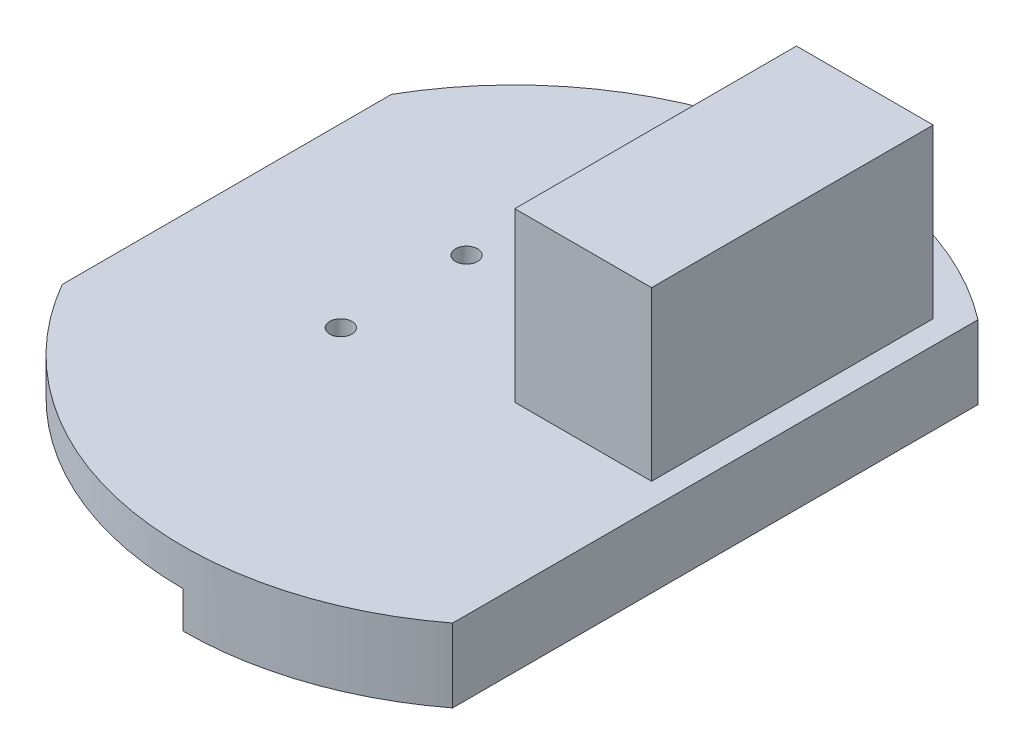
ISO-10303-21;
HEADER;
FILE_DESCRIPTION(('STEP AP214'),'2;1');
FILE_NAME('part.step','',(''),(''),'','','');
FILE_SCHEMA(('AUTOMOTIVE_DESIGN { 1 0 10303 214 1 1 1 1 }'));
ENDSEC;
DATA;
#1=APPLICATION_CONTEXT('core data for automotive mechanical design processes');
#2=APPLICATION_PROTOCOL_DEFINITION('international standard','automotive_design',2000,#1);
#3=PRODUCT_CONTEXT('',#1,'mechanical');
#4=PRODUCT('Part','Part','',(#3));
#5=PRODUCT_RELATED_PRODUCT_CATEGORY('part','',(#4));
#6=PRODUCT_DEFINITION_FORMATION('','',#4);
#7=PRODUCT_DEFINITION_CONTEXT('part definition',#1,'design');
#8=PRODUCT_DEFINITION('design','',#6,#7);
#9=PRODUCT_DEFINITION_SHAPE('','',#8);
#10=(LENGTH_UNIT() NAMED_UNIT(*) SI_UNIT(.MILLI.,.METRE.));
#11=(NAMED_UNIT(*) PLANE_ANGLE_UNIT() SI_UNIT($,.RADIAN.));
#12=(NAMED_UNIT(*) SI_UNIT($,.STERADIAN.) SOLID_ANGLE_UNIT());
#13=UNCERTAINTY_MEASURE_WITH_UNIT(LENGTH_MEASURE(1.E-05),#10,'distance_accuracy_value','');
#14=(GEOMETRIC_REPRESENTATION_CONTEXT(3) GLOBAL_UNCERTAINTY_ASSIGNED_CONTEXT((#13)) GLOBAL_UNIT_ASSIGNED_CONTEXT((#10,
#11,#12)) REPRESENTATION_CONTEXT('',''));
#15=CARTESIAN_POINT('',(0.,0.,0.));
#16=DIRECTION('',(0.,0.,1.));
#17=DIRECTION('',(1.,0.,0.));
#18=AXIS2_PLACEMENT_3D('',#15,#16,#17);
#19=CARTESIAN_POINT('',(21.2045309307479,24.8,2.49999999999998));
#20=DIRECTION('',(0.,0.,-1.));
#21=DIRECTION('',(-1.,0.,0.));
#22=AXIS2_PLACEMENT_3D('',#19,#20,#21);
#23=PLANE('',#22);
#24=DIRECTION('',(0.,-1.,0.));
#25=VECTOR('',#24,1.);
#26=CARTESIAN_POINT('',(8.60453093074795,24.8,2.49999999999999));
#27=LINE('',#26,#25);
#28=CARTESIAN_POINT('',(8.60453093074795,9.6,2.49999999999999));
#29=VERTEX_POINT('',#28);
#30=CARTESIAN_POINT('',(8.60453093074795,0.,2.49999999999999));
#31=VERTEX_POINT('',#30);
#32=EDGE_CURVE('E384',#29,#31,#27,.T.);
#33=ORIENTED_EDGE('',*,*,#32,.F.);
#34=DIRECTION('',(1.,0.,0.));
#35=VECTOR('',#34,1.);
#36=CARTESIAN_POINT('',(8.60453093074795,9.6,2.49999999999999));
#37=LINE('',#36,#35);
#38=CARTESIAN_POINT('',(21.2045309307479,9.60000000000001,2.49999999999998));
#39=VERTEX_POINT('',#38);
#40=EDGE_CURVE('E302',#29,#39,#37,.T.);
#41=ORIENTED_EDGE('',*,*,#40,.T.);
#42=DIRECTION('',(0.,-1.,0.));
#43=VECTOR('',#42,1.);
#44=CARTESIAN_POINT('',(21.2045309307479,24.8,2.49999999999998));
#45=LINE('',#44,#43);
#46=CARTESIAN_POINT('',(21.2045309307479,0.,2.49999999999998));
#47=VERTEX_POINT('',#46);
#48=EDGE_CURVE('E381',#39,#47,#45,.T.);
#49=ORIENTED_EDGE('',*,*,#48,.T.);
#50=DIRECTION('',(1.,0.,0.));
#51=VECTOR('',#50,1.);
#52=CARTESIAN_POINT('',(21.2045309307479,0.,2.49999999999998));
#53=LINE('',#52,#51);
#54=EDGE_CURVE('E12',#31,#47,#53,.T.);
#55=ORIENTED_EDGE('',*,*,#54,.F.);
#56=EDGE_LOOP('',(#33,#41,#49,#55));
#57=FACE_BOUND('',#56,.T.);
#58=ADVANCED_FACE('F55',(#57),#23,.T.);
#59=CARTESIAN_POINT('',(0.,24.8,0.));
#60=DIRECTION('',(0.,1.,0.));
#61=DIRECTION('',(0.,0.,1.));
#62=AXIS2_PLACEMENT_3D('',#59,#60,#61);
#63=PLANE('',#62);
#64=DIRECTION('',(0.,0.,-1.));
#65=VECTOR('',#64,1.);
#66=CARTESIAN_POINT('',(21.2045309307479,24.8,2.49999999999998));
#67=LINE('',#66,#65);
#68=CARTESIAN_POINT('',(21.2045309307479,24.8,-2.20000000000001));
#69=VERTEX_POINT('',#68);
#70=CARTESIAN_POINT('',(21.2045309307479,24.8,-25.1));
#71=VERTEX_POINT('',#70);
#72=EDGE_CURVE('E374',#69,#71,#67,.T.);
#73=ORIENTED_EDGE('',*,*,#72,.F.);
#74=DIRECTION('',(-1.,0.,0.));
#75=VECTOR('',#74,1.);
#76=CARTESIAN_POINT('',(8.60453093074795,24.8,-2.20000000000001));
#77=LINE('',#76,#75);
#78=CARTESIAN_POINT('',(8.60453093074795,24.8,-2.20000000000001));
#79=VERTEX_POINT('',#78);
#80=EDGE_CURVE('E288',#69,#79,#77,.T.);
#81=ORIENTED_EDGE('',*,*,#80,.T.);
#82=DIRECTION('',(0.,0.,1.));
#83=VECTOR('',#82,1.);
#84=CARTESIAN_POINT('',(8.60453093074795,24.8,2.49999999999999));
#85=LINE('',#84,#83);
#86=CARTESIAN_POINT('',(8.60453093074795,24.8,-25.1));
#87=VERTEX_POINT('',#86);
#88=EDGE_CURVE('E377',#87,#79,#85,.T.);
#89=ORIENTED_EDGE('',*,*,#88,.F.);
#90=DIRECTION('',(-1.,0.,0.));
#91=VECTOR('',#90,1.);
#92=CARTESIAN_POINT('',(8.60453093074795,24.8,-25.1));
#93=LINE('',#92,#91);
#94=EDGE_CURVE('E320',#71,#87,#93,.T.);
#95=ORIENTED_EDGE('',*,*,#94,.F.);
#96=EDGE_LOOP('',(#73,#81,#89,#95));
#97=FACE_BOUND('',#96,.T.);
#98=ADVANCED_FACE('F506',(#97),#63,.F.);
#99=CARTESIAN_POINT('',(8.60453093074795,24.8,2.49999999999999));
#100=DIRECTION('',(1.,0.,0.));
#101=DIRECTION('',(0.,0.,-1.));
#102=AXIS2_PLACEMENT_3D('',#99,#100,#101);
#103=PLANE('',#102);
#104=DIRECTION('',(0.,1.,0.));
#105=VECTOR('',#104,1.);
#106=CARTESIAN_POINT('',(8.60453093074795,9.6,-2.20000000000001));
#107=LINE('',#106,#105);
#108=CARTESIAN_POINT('',(8.60453093074795,9.6,-2.20000000000001));
#109=VERTEX_POINT('',#108);
#110=EDGE_CURVE('E312',#109,#79,#107,.T.);
#111=ORIENTED_EDGE('',*,*,#110,.F.);
#112=DIRECTION('',(0.,0.,1.));
#113=VECTOR('',#112,1.);
#114=CARTESIAN_POINT('',(8.60453093074795,9.6,2.49999999999999));
#115=LINE('',#114,#113);
#116=EDGE_CURVE('E292',#109,#29,#115,.T.);
#117=ORIENTED_EDGE('',*,*,#116,.T.);
#118=ORIENTED_EDGE('',*,*,#32,.T.);
#119=DIRECTION('',(0.,0.,1.));
#120=VECTOR('',#119,1.);
#121=CARTESIAN_POINT('',(8.60453093074795,0.,2.49999999999999));
#122=LINE('',#121,#120);
#123=CARTESIAN_POINT('',(8.60453093074795,0.,-29.8));
#124=VERTEX_POINT('',#123);
#125=EDGE_CURVE('E346',#124,#31,#122,.T.);
#126=ORIENTED_EDGE('',*,*,#125,.F.);
#127=DIRECTION('',(0.,-1.,0.));
#128=VECTOR('',#127,1.);
#129=CARTESIAN_POINT('',(8.60453093074795,24.8,-29.8));
#130=LINE('',#129,#128);
#131=CARTESIAN_POINT('',(8.60453093074795,9.6,-29.8));
#132=VERTEX_POINT('',#131);
#133=EDGE_CURVE('E387',#132,#124,#130,.T.);
#134=ORIENTED_EDGE('',*,*,#133,.F.);
#135=DIRECTION('',(0.,0.,-1.));
#136=VECTOR('',#135,1.);
#137=CARTESIAN_POINT('',(8.60453093074795,9.6,-29.8));
#138=LINE('',#137,#136);
#139=CARTESIAN_POINT('',(8.60453093074795,9.6,-25.1));
#140=VERTEX_POINT('',#139);
#141=EDGE_CURVE('E324',#140,#132,#138,.T.);
#142=ORIENTED_EDGE('',*,*,#141,.F.);
#143=DIRECTION('',(0.,1.,0.));
#144=VECTOR('',#143,1.);
#145=CARTESIAN_POINT('',(8.60453093074795,9.6,-25.1));
#146=LINE('',#145,#144);
#147=EDGE_CURVE('E336',#140,#87,#146,.T.);
#148=ORIENTED_EDGE('',*,*,#147,.T.);
#149=ORIENTED_EDGE('',*,*,#88,.T.);
#150=EDGE_LOOP('',(#111,#117,#118,#126,#134,#142,#148,#149));
#151=FACE_BOUND('',#150,.T.);
#152=ADVANCED_FACE('F513',(#151),#103,.T.);
#153=CARTESIAN_POINT('',(21.2045309307479,24.8,-29.8));
#154=DIRECTION('',(0.,0.,1.));
#155=DIRECTION('',(1.,0.,0.));
#156=AXIS2_PLACEMENT_3D('',#153,#154,#155);
#157=PLANE('',#156);
#158=DIRECTION('',(0.,-1.,0.));
#159=VECTOR('',#158,1.);
#160=CARTESIAN_POINT('',(21.2045309307479,24.8,-29.8));
#161=LINE('',#160,#159);
#162=CARTESIAN_POINT('',(21.2045309307479,9.60000000000001,-29.8));
#163=VERTEX_POINT('',#162);
#164=CARTESIAN_POINT('',(21.2045309307479,0.,-29.8));
#165=VERTEX_POINT('',#164);
#166=EDGE_CURVE('E390',#163,#165,#161,.T.);
#167=ORIENTED_EDGE('',*,*,#166,.F.);
#168=DIRECTION('',(1.,0.,0.));
#169=VECTOR('',#168,1.);
#170=CARTESIAN_POINT('',(8.60453093074795,9.6,-29.8));
#171=LINE('',#170,#169);
#172=EDGE_CURVE('E327',#132,#163,#171,.T.);
#173=ORIENTED_EDGE('',*,*,#172,.F.);
#174=ORIENTED_EDGE('',*,*,#133,.T.);
#175=DIRECTION('',(-1.,0.,0.));
#176=VECTOR('',#175,1.);
#177=CARTESIAN_POINT('',(21.2045309307479,0.,-29.8));
#178=LINE('',#177,#176);
#179=EDGE_CURVE('E350',#165,#124,#178,.T.);
#180=ORIENTED_EDGE('',*,*,#179,.F.);
#181=EDGE_LOOP('',(#167,#173,#174,#180));
#182=FACE_BOUND('',#181,.T.);
#183=ADVANCED_FACE('F521',(#182),#157,.T.);
#184=CARTESIAN_POINT('',(21.2045309307479,24.8,2.49999999999998));
#185=DIRECTION('',(-1.,0.,0.));
#186=DIRECTION('',(0.,0.,1.));
#187=AXIS2_PLACEMENT_3D('',#184,#185,#186);
#188=PLANE('',#187);
#189=DIRECTION('',(0.,1.,0.));
#190=VECTOR('',#189,1.);
#191=CARTESIAN_POINT('',(21.2045309307479,9.6,-2.20000000000001));
#192=LINE('',#191,#190);
#193=CARTESIAN_POINT('',(21.2045309307479,9.6,-2.20000000000001));
#194=VERTEX_POINT('',#193);
#195=EDGE_CURVE('E305',#194,#69,#192,.T.);
#196=ORIENTED_EDGE('',*,*,#195,.T.);
#197=ORIENTED_EDGE('',*,*,#72,.T.);
#198=DIRECTION('',(0.,1.,0.));
#199=VECTOR('',#198,1.);
#200=CARTESIAN_POINT('',(21.2045309307479,9.6,-25.1));
#201=LINE('',#200,#199);
#202=CARTESIAN_POINT('',(21.2045309307479,9.6,-25.1));
#203=VERTEX_POINT('',#202);
#204=EDGE_CURVE('E342',#203,#71,#201,.T.);
#205=ORIENTED_EDGE('',*,*,#204,.F.);
#206=DIRECTION('',(0.,0.,1.));
#207=VECTOR('',#206,1.);
#208=CARTESIAN_POINT('',(21.2045309307479,9.6,-29.8));
#209=LINE('',#208,#207);
#210=EDGE_CURVE('E330',#163,#203,#209,.T.);
#211=ORIENTED_EDGE('',*,*,#210,.F.);
#212=ORIENTED_EDGE('',*,*,#166,.T.);
#213=DIRECTION('',(0.,0.,-1.));
#214=VECTOR('',#213,1.);
#215=CARTESIAN_POINT('',(21.2045309307479,0.,2.49999999999998));
#216=LINE('',#215,#214);
#217=EDGE_CURVE('E354',#47,#165,#216,.T.);
#218=ORIENTED_EDGE('',*,*,#217,.F.);
#219=ORIENTED_EDGE('',*,*,#48,.F.);
#220=DIRECTION('',(0.,0.,-1.));
#221=VECTOR('',#220,1.);
#222=CARTESIAN_POINT('',(21.2045309307479,9.6,2.49999999999999));
#223=LINE('',#222,#221);
#224=EDGE_CURVE('E79',#39,#194,#223,.T.);
#225=ORIENTED_EDGE('',*,*,#224,.T.);
#226=EDGE_LOOP('',(#196,#197,#205,#211,#212,#218,#219,#225));
#227=FACE_BOUND('',#226,.T.);
#228=ADVANCED_FACE('F524',(#227),#188,.T.);
#229=CARTESIAN_POINT('',(0.,0.,0.));
#230=DIRECTION('',(0.,1.,0.));
#231=DIRECTION('',(0.,0.,1.));
#232=AXIS2_PLACEMENT_3D('',#229,#230,#231);
#233=PLANE('',#232);
#234=CARTESIAN_POINT('',(0.,0.,0.));
#235=DIRECTION('',(0.,-1.,0.));
#236=DIRECTION('',(0.,0.,-1.));
#237=AXIS2_PLACEMENT_3D('',#234,#235,#236);
#238=CIRCLE('',#237,42.);
#239=CARTESIAN_POINT('',(25.3745309307479,0.,33.4683907597081));
#240=VERTEX_POINT('',#239);
#241=CARTESIAN_POINT('',(0.,0.,42.));
#242=VERTEX_POINT('',#241);
#243=EDGE_CURVE('E71',#240,#242,#238,.T.);
#244=ORIENTED_EDGE('',*,*,#243,.T.);
#245=DIRECTION('',(0.,0.,1.));
#246=VECTOR('',#245,1.);
#247=CARTESIAN_POINT('',(0.,0.,0.));
#248=LINE('',#247,#246);
#249=CARTESIAN_POINT('',(0.,0.,45.));
#250=VERTEX_POINT('',#249);
#251=EDGE_CURVE('E226',#242,#250,#248,.T.);
#252=ORIENTED_EDGE('',*,*,#251,.T.);
#253=CARTESIAN_POINT('',(0.,0.,0.));
#254=DIRECTION('',(0.,1.,0.));
#255=DIRECTION('',(0.,0.,1.));
#256=AXIS2_PLACEMENT_3D('',#253,#254,#255);
#257=CIRCLE('',#256,45.);
#258=CARTESIAN_POINT('',(-39.0385613575621,0.,22.3828221440429));
#259=VERTEX_POINT('',#258);
#260=EDGE_CURVE('E414',#259,#250,#257,.T.);
#261=ORIENTED_EDGE('',*,*,#260,.F.);
#262=DIRECTION('',(0.,0.,-1.));
#263=VECTOR('',#262,1.);
#264=CARTESIAN_POINT('',(-39.0385613575621,0.,0.));
#265=LINE('',#264,#263);
#266=CARTESIAN_POINT('',(-39.0385613575621,0.,-22.3828221440429));
#267=VERTEX_POINT('',#266);
#268=EDGE_CURVE('E443',#259,#267,#265,.T.);
#269=ORIENTED_EDGE('',*,*,#268,.T.);
#270=CARTESIAN_POINT('',(0.,0.,0.));
#271=DIRECTION('',(0.,1.,0.));
#272=DIRECTION('',(0.,0.,1.));
#273=AXIS2_PLACEMENT_3D('',#270,#271,#272);
#274=CIRCLE('',#273,45.);
#275=CARTESIAN_POINT('',(0.,0.,-45.));
#276=VERTEX_POINT('',#275);
#277=EDGE_CURVE('E440',#276,#267,#274,.T.);
#278=ORIENTED_EDGE('',*,*,#277,.F.);
#279=DIRECTION('',(0.,0.,1.));
#280=VECTOR('',#279,1.);
#281=CARTESIAN_POINT('',(0.,0.,0.));
#282=LINE('',#281,#280);
#283=CARTESIAN_POINT('',(0.,0.,-42.));
#284=VERTEX_POINT('',#283);
#285=EDGE_CURVE('E264',#276,#284,#282,.T.);
#286=ORIENTED_EDGE('',*,*,#285,.T.);
#287=CARTESIAN_POINT('',(0.,0.,0.));
#288=DIRECTION('',(0.,-1.,0.));
#289=DIRECTION('',(0.,0.,-1.));
#290=AXIS2_PLACEMENT_3D('',#287,#288,#289);
#291=CIRCLE('',#290,42.);
#292=CARTESIAN_POINT('',(25.3745309307479,0.,-33.4683907597081));
#293=VERTEX_POINT('',#292);
#294=EDGE_CURVE('E260',#284,#293,#291,.T.);
#295=ORIENTED_EDGE('',*,*,#294,.T.);
#296=DIRECTION('',(0.,0.,1.));
#297=VECTOR('',#296,1.);
#298=CARTESIAN_POINT('',(25.3745309307479,0.,0.));
#299=LINE('',#298,#297);
#300=EDGE_CURVE('E256',#293,#240,#299,.T.);
#301=ORIENTED_EDGE('',*,*,#300,.T.);
#302=EDGE_LOOP('',(#244,#252,#261,#269,#278,#286,#295,#301));
#303=FACE_BOUND('',#302,.T.);
#304=CARTESIAN_POINT('',(-15.,0.,-8.55000000000001));
#305=DIRECTION('',(0.,1.,0.));
#306=DIRECTION('',(0.,0.,1.));
#307=AXIS2_PLACEMENT_3D('',#304,#305,#306);
#308=CIRCLE('',#307,1.5);
#309=CARTESIAN_POINT('',(-15.,0.,-7.05000000000001));
#310=VERTEX_POINT('',#309);
#311=EDGE_CURVE('E436',#310,#310,#308,.T.);
#312=ORIENTED_EDGE('',*,*,#311,.T.);
#313=EDGE_LOOP('',(#312));
#314=FACE_BOUND('',#313,.T.);
#315=CARTESIAN_POINT('',(-15.,0.,8.54999999999999));
#316=DIRECTION('',(0.,1.,0.));
#317=DIRECTION('',(0.,0.,1.));
#318=AXIS2_PLACEMENT_3D('',#315,#316,#317);
#319=CIRCLE('',#318,1.5);
#320=CARTESIAN_POINT('',(-15.,0.,10.05));
#321=VERTEX_POINT('',#320);
#322=EDGE_CURVE('E408',#321,#321,#319,.T.);
#323=ORIENTED_EDGE('',*,*,#322,.T.);
#324=EDGE_LOOP('',(#323));
#325=FACE_BOUND('',#324,.T.);
#326=ORIENTED_EDGE('',*,*,#217,.T.);
#327=ORIENTED_EDGE('',*,*,#179,.T.);
#328=ORIENTED_EDGE('',*,*,#125,.T.);
#329=ORIENTED_EDGE('',*,*,#54,.T.);
#330=EDGE_LOOP('',(#326,#327,#328,#329));
#331=FACE_BOUND('',#330,.T.);
#332=ADVANCED_FACE('F527',(#303,#314,#325,#331),#233,.F.);
#333=CARTESIAN_POINT('',(0.,5.,0.));
#334=DIRECTION('',(0.,1.,0.));
#335=DIRECTION('',(0.,0.,1.));
#336=AXIS2_PLACEMENT_3D('',#333,#334,#335);
#337=PLANE('',#336);
#338=DIRECTION('',(0.,0.,-1.));
#339=VECTOR('',#338,1.);
#340=CARTESIAN_POINT('',(27.3745309307479,5.,0.));
#341=LINE('',#340,#339);
#342=CARTESIAN_POINT('',(27.3745309307479,5.,35.7160336028726));
#343=VERTEX_POINT('',#342);
#344=CARTESIAN_POINT('',(27.3745309307479,5.,-35.7160336028726));
#345=VERTEX_POINT('',#344);
#346=EDGE_CURVE('E418',#343,#345,#341,.T.);
#347=ORIENTED_EDGE('',*,*,#346,.T.);
#348=CARTESIAN_POINT('',(0.,5.,0.));
#349=DIRECTION('',(0.,1.,0.));
#350=DIRECTION('',(0.,0.,1.));
#351=AXIS2_PLACEMENT_3D('',#348,#349,#350);
#352=CIRCLE('',#351,45.);
#353=CARTESIAN_POINT('',(-39.0385613575621,5.,-22.3828221440429));
#354=VERTEX_POINT('',#353);
#355=EDGE_CURVE('E422',#345,#354,#352,.T.);
#356=ORIENTED_EDGE('',*,*,#355,.T.);
#357=DIRECTION('',(0.,0.,-1.));
#358=VECTOR('',#357,1.);
#359=CARTESIAN_POINT('',(-39.0385613575621,5.,0.));
#360=LINE('',#359,#358);
#361=CARTESIAN_POINT('',(-39.0385613575621,5.,22.3828221440429));
#362=VERTEX_POINT('',#361);
#363=EDGE_CURVE('E425',#362,#354,#360,.T.);
#364=ORIENTED_EDGE('',*,*,#363,.F.);
#365=CARTESIAN_POINT('',(0.,5.,0.));
#366=DIRECTION('',(0.,1.,0.));
#367=DIRECTION('',(0.,0.,1.));
#368=AXIS2_PLACEMENT_3D('',#365,#366,#367);
#369=CIRCLE('',#368,45.);
#370=EDGE_CURVE('E429',#362,#343,#369,.T.);
#371=ORIENTED_EDGE('',*,*,#370,.T.);
#372=EDGE_LOOP('',(#347,#356,#364,#371));
#373=FACE_BOUND('',#372,.T.);
#374=CARTESIAN_POINT('',(-15.,5.,-8.55000000000001));
#375=DIRECTION('',(0.,1.,0.));
#376=DIRECTION('',(0.,0.,1.));
#377=AXIS2_PLACEMENT_3D('',#374,#375,#376);
#378=CIRCLE('',#377,1.5);
#379=CARTESIAN_POINT('',(-15.,5.,-7.05000000000001));
#380=VERTEX_POINT('',#379);
#381=EDGE_CURVE('E413',#380,#380,#378,.T.);
#382=ORIENTED_EDGE('',*,*,#381,.F.);
#383=EDGE_LOOP('',(#382));
#384=FACE_BOUND('',#383,.T.);
#385=CARTESIAN_POINT('',(-15.,5.,8.54999999999999));
#386=DIRECTION('',(0.,1.,0.));
#387=DIRECTION('',(0.,0.,1.));
#388=AXIS2_PLACEMENT_3D('',#385,#386,#387);
#389=CIRCLE('',#388,1.5);
#390=CARTESIAN_POINT('',(-15.,5.,10.05));
#391=VERTEX_POINT('',#390);
#392=EDGE_CURVE('E409',#391,#391,#389,.T.);
#393=ORIENTED_EDGE('',*,*,#392,.F.);
#394=EDGE_LOOP('',(#393));
#395=FACE_BOUND('',#394,.T.);
#396=DIRECTION('',(-1.,0.,0.));
#397=VECTOR('',#396,1.);
#398=CARTESIAN_POINT('',(0.,5.,5.49999999999998));
#399=LINE('',#398,#397);
#400=CARTESIAN_POINT('',(24.2045309307479,5.00000000000001,5.49999999999998));
#401=VERTEX_POINT('',#400);
#402=CARTESIAN_POINT('',(5.60453093074795,5.00000000000001,5.49999999999998));
#403=VERTEX_POINT('',#402);
#404=EDGE_CURVE('E470',#401,#403,#399,.T.);
#405=ORIENTED_EDGE('',*,*,#404,.T.);
#406=DIRECTION('',(0.,0.,-1.));
#407=VECTOR('',#406,1.);
#408=CARTESIAN_POINT('',(5.60453093074795,5.,0.));
#409=LINE('',#408,#407);
#410=CARTESIAN_POINT('',(5.60453093074795,5.00000000000001,-32.8));
#411=VERTEX_POINT('',#410);
#412=EDGE_CURVE('E64',#403,#411,#409,.T.);
#413=ORIENTED_EDGE('',*,*,#412,.T.);
#414=DIRECTION('',(1.,0.,0.));
#415=VECTOR('',#414,1.);
#416=CARTESIAN_POINT('',(0.,5.,-32.8));
#417=LINE('',#416,#415);
#418=CARTESIAN_POINT('',(24.2045309307479,5.,-32.8));
#419=VERTEX_POINT('',#418);
#420=EDGE_CURVE('E462',#411,#419,#417,.T.);
#421=ORIENTED_EDGE('',*,*,#420,.T.);
#422=DIRECTION('',(0.,0.,1.));
#423=VECTOR('',#422,1.);
#424=CARTESIAN_POINT('',(24.2045309307479,5.,0.));
#425=LINE('',#424,#423);
#426=EDGE_CURVE('E466',#419,#401,#425,.T.);
#427=ORIENTED_EDGE('',*,*,#426,.T.);
#428=EDGE_LOOP('',(#405,#413,#421,#427));
#429=FACE_BOUND('',#428,.T.);
#430=ADVANCED_FACE('F476',(#373,#384,#395,#429),#337,.T.);
#431=CARTESIAN_POINT('',(-15.,5.,8.54999999999999));
#432=DIRECTION('',(0.,-1.,0.));
#433=DIRECTION('',(0.,0.,-1.));
#434=AXIS2_PLACEMENT_3D('',#431,#432,#433);
#435=CYLINDRICAL_SURFACE('',#434,1.5);
#436=ORIENTED_EDGE('',*,*,#392,.T.);
#437=EDGE_LOOP('',(#436));
#438=FACE_BOUND('',#437,.T.);
#439=ORIENTED_EDGE('',*,*,#322,.F.);
#440=EDGE_LOOP('',(#439));
#441=FACE_BOUND('',#440,.T.);
#442=ADVANCED_FACE('F57',(#438,#441),#435,.F.);
#443=CARTESIAN_POINT('',(-15.,5.,-8.55000000000001));
#444=DIRECTION('',(0.,-1.,0.));
#445=DIRECTION('',(0.,0.,-1.));
#446=AXIS2_PLACEMENT_3D('',#443,#444,#445);
#447=CYLINDRICAL_SURFACE('',#446,1.5);
#448=ORIENTED_EDGE('',*,*,#381,.T.);
#449=EDGE_LOOP('',(#448));
#450=FACE_BOUND('',#449,.T.);
#451=ORIENTED_EDGE('',*,*,#311,.F.);
#452=EDGE_LOOP('',(#451));
#453=FACE_BOUND('',#452,.T.);
#454=ADVANCED_FACE('F603',(#450,#453),#447,.F.);
#455=CARTESIAN_POINT('',(0.,5.,0.));
#456=DIRECTION('',(0.,-1.,0.));
#457=DIRECTION('',(0.,0.,-1.));
#458=AXIS2_PLACEMENT_3D('',#455,#456,#457);
#459=CYLINDRICAL_SURFACE('',#458,45.);
#460=DIRECTION('',(0.,-1.,0.));
#461=VECTOR('',#460,1.);
#462=CARTESIAN_POINT('',(27.3745309307479,5.,-35.7160336028726));
#463=LINE('',#462,#461);
#464=CARTESIAN_POINT('',(27.3745309307479,-5.,-35.7160336028726));
#465=VERTEX_POINT('',#464);
#466=EDGE_CURVE('E459',#345,#465,#463,.T.);
#467=ORIENTED_EDGE('',*,*,#466,.T.);
#468=CARTESIAN_POINT('',(0.,-5.,0.));
#469=DIRECTION('',(0.,-1.,0.));
#470=DIRECTION('',(0.,0.,-1.));
#471=AXIS2_PLACEMENT_3D('',#468,#469,#470);
#472=CIRCLE('',#471,45.);
#473=CARTESIAN_POINT('',(0.,-5.,-45.));
#474=VERTEX_POINT('',#473);
#475=EDGE_CURVE('E240',#474,#465,#472,.T.);
#476=ORIENTED_EDGE('',*,*,#475,.F.);
#477=DIRECTION('',(0.,1.,0.));
#478=VECTOR('',#477,1.);
#479=CARTESIAN_POINT('',(0.,-5.,-45.));
#480=LINE('',#479,#478);
#481=EDGE_CURVE('E276',#474,#276,#480,.T.);
#482=ORIENTED_EDGE('',*,*,#481,.T.);
#483=ORIENTED_EDGE('',*,*,#277,.T.);
#484=DIRECTION('',(0.,-1.,0.));
#485=VECTOR('',#484,1.);
#486=CARTESIAN_POINT('',(-39.0385613575621,5.,-22.3828221440429));
#487=LINE('',#486,#485);
#488=EDGE_CURVE('E455',#354,#267,#487,.T.);
#489=ORIENTED_EDGE('',*,*,#488,.F.);
#490=ORIENTED_EDGE('',*,*,#355,.F.);
#491=EDGE_LOOP('',(#467,#476,#482,#483,#489,#490));
#492=FACE_BOUND('',#491,.T.);
#493=ADVANCED_FACE('F600',(#492),#459,.T.);
#494=CARTESIAN_POINT('',(-39.0385613575621,5.,0.));
#495=DIRECTION('',(-1.,0.,0.));
#496=DIRECTION('',(0.,0.,1.));
#497=AXIS2_PLACEMENT_3D('',#494,#495,#496);
#498=PLANE('',#497);
#499=ORIENTED_EDGE('',*,*,#268,.F.);
#500=DIRECTION('',(0.,-1.,0.));
#501=VECTOR('',#500,1.);
#502=CARTESIAN_POINT('',(-39.0385613575621,5.,22.3828221440429));
#503=LINE('',#502,#501);
#504=EDGE_CURVE('E452',#362,#259,#503,.T.);
#505=ORIENTED_EDGE('',*,*,#504,.F.);
#506=ORIENTED_EDGE('',*,*,#363,.T.);
#507=ORIENTED_EDGE('',*,*,#488,.T.);
#508=EDGE_LOOP('',(#499,#505,#506,#507));
#509=FACE_BOUND('',#508,.T.);
#510=ADVANCED_FACE('F597',(#509),#498,.T.);
#511=CARTESIAN_POINT('',(0.,5.,0.));
#512=DIRECTION('',(0.,-1.,0.));
#513=DIRECTION('',(0.,0.,-1.));
#514=AXIS2_PLACEMENT_3D('',#511,#512,#513);
#515=CYLINDRICAL_SURFACE('',#514,45.);
#516=ORIENTED_EDGE('',*,*,#260,.T.);
#517=DIRECTION('',(0.,1.,0.));
#518=VECTOR('',#517,1.);
#519=CARTESIAN_POINT('',(0.,-5.,45.));
#520=LINE('',#519,#518);
#521=CARTESIAN_POINT('',(0.,-5.,45.));
#522=VERTEX_POINT('',#521);
#523=EDGE_CURVE('E273',#522,#250,#520,.T.);
#524=ORIENTED_EDGE('',*,*,#523,.F.);
#525=CARTESIAN_POINT('',(0.,-5.,0.));
#526=DIRECTION('',(0.,-1.,0.));
#527=DIRECTION('',(0.,0.,-1.));
#528=AXIS2_PLACEMENT_3D('',#525,#526,#527);
#529=CIRCLE('',#528,45.);
#530=CARTESIAN_POINT('',(27.3745309307479,-5.,35.7160336028726));
#531=VERTEX_POINT('',#530);
#532=EDGE_CURVE('E248',#531,#522,#529,.T.);
#533=ORIENTED_EDGE('',*,*,#532,.F.);
#534=DIRECTION('',(0.,-1.,0.));
#535=VECTOR('',#534,1.);
#536=CARTESIAN_POINT('',(27.3745309307479,5.,35.7160336028726));
#537=LINE('',#536,#535);
#538=EDGE_CURVE('E432',#343,#531,#537,.T.);
#539=ORIENTED_EDGE('',*,*,#538,.F.);
#540=ORIENTED_EDGE('',*,*,#370,.F.);
#541=ORIENTED_EDGE('',*,*,#504,.T.);
#542=EDGE_LOOP('',(#516,#524,#533,#539,#540,#541));
#543=FACE_BOUND('',#542,.T.);
#544=ADVANCED_FACE('F501',(#543),#515,.T.);
#545=CARTESIAN_POINT('',(27.3745309307479,5.,0.));
#546=DIRECTION('',(-1.,0.,0.));
#547=DIRECTION('',(0.,0.,1.));
#548=AXIS2_PLACEMENT_3D('',#545,#546,#547);
#549=PLANE('',#548);
#550=ORIENTED_EDGE('',*,*,#538,.T.);
#551=DIRECTION('',(0.,0.,1.));
#552=VECTOR('',#551,1.);
#553=CARTESIAN_POINT('',(27.3745309307479,-5.,0.));
#554=LINE('',#553,#552);
#555=EDGE_CURVE('E244',#465,#531,#554,.T.);
#556=ORIENTED_EDGE('',*,*,#555,.F.);
#557=ORIENTED_EDGE('',*,*,#466,.F.);
#558=ORIENTED_EDGE('',*,*,#346,.F.);
#559=EDGE_LOOP('',(#550,#556,#557,#558));
#560=FACE_BOUND('',#559,.T.);
#561=ADVANCED_FACE('F493',(#560),#549,.F.);
#562=CARTESIAN_POINT('',(24.2045309307479,24.8,-32.8));
#563=DIRECTION('',(0.,0.,1.));
#564=DIRECTION('',(1.,0.,0.));
#565=AXIS2_PLACEMENT_3D('',#562,#563,#564);
#566=PLANE('',#565);
#567=ORIENTED_EDGE('',*,*,#420,.F.);
#568=DIRECTION('',(0.,-1.,0.));
#569=VECTOR('',#568,1.);
#570=CARTESIAN_POINT('',(5.60453093074795,24.8,-32.8));
#571=LINE('',#570,#569);
#572=CARTESIAN_POINT('',(5.60453093074795,27.8,-32.8));
#573=VERTEX_POINT('',#572);
#574=EDGE_CURVE('E393',#573,#411,#571,.T.);
#575=ORIENTED_EDGE('',*,*,#574,.F.);
#576=DIRECTION('',(-1.,0.,0.));
#577=VECTOR('',#576,1.);
#578=CARTESIAN_POINT('',(24.2045309307479,27.8,-32.8));
#579=LINE('',#578,#577);
#580=CARTESIAN_POINT('',(24.2045309307479,27.8,-32.8));
#581=VERTEX_POINT('',#580);
#582=EDGE_CURVE('E362',#581,#573,#579,.T.);
#583=ORIENTED_EDGE('',*,*,#582,.F.);
#584=DIRECTION('',(0.,-1.,0.));
#585=VECTOR('',#584,1.);
#586=CARTESIAN_POINT('',(24.2045309307479,24.8,-32.8));
#587=LINE('',#586,#585);
#588=EDGE_CURVE('E397',#581,#419,#587,.T.);
#589=ORIENTED_EDGE('',*,*,#588,.T.);
#590=EDGE_LOOP('',(#567,#575,#583,#589));
#591=FACE_BOUND('',#590,.T.);
#592=ADVANCED_FACE('F491',(#591),#566,.F.);
#593=CARTESIAN_POINT('',(24.2045309307479,24.8,5.49999999999998));
#594=DIRECTION('',(-1.,0.,0.));
#595=DIRECTION('',(0.,0.,1.));
#596=AXIS2_PLACEMENT_3D('',#593,#594,#595);
#597=PLANE('',#596);
#598=ORIENTED_EDGE('',*,*,#426,.F.);
#599=ORIENTED_EDGE('',*,*,#588,.F.);
#600=DIRECTION('',(0.,0.,-1.));
#601=VECTOR('',#600,1.);
#602=CARTESIAN_POINT('',(24.2045309307479,27.8,5.49999999999998));
#603=LINE('',#602,#601);
#604=CARTESIAN_POINT('',(24.2045309307479,27.8,5.49999999999998));
#605=VERTEX_POINT('',#604);
#606=EDGE_CURVE('E358',#605,#581,#603,.T.);
#607=ORIENTED_EDGE('',*,*,#606,.F.);
#608=DIRECTION('',(0.,-1.,0.));
#609=VECTOR('',#608,1.);
#610=CARTESIAN_POINT('',(24.2045309307479,24.8,5.49999999999998));
#611=LINE('',#610,#609);
#612=EDGE_CURVE('E400',#605,#401,#611,.T.);
#613=ORIENTED_EDGE('',*,*,#612,.T.);
#614=EDGE_LOOP('',(#598,#599,#607,#613));
#615=FACE_BOUND('',#614,.T.);
#616=ADVANCED_FACE('F488',(#615),#597,.F.);
#617=CARTESIAN_POINT('',(24.2045309307479,24.8,5.49999999999998));
#618=DIRECTION('',(0.,0.,-1.));
#619=DIRECTION('',(-1.,0.,0.));
#620=AXIS2_PLACEMENT_3D('',#617,#618,#619);
#621=PLANE('',#620);
#622=ORIENTED_EDGE('',*,*,#404,.F.);
#623=ORIENTED_EDGE('',*,*,#612,.F.);
#624=DIRECTION('',(1.,0.,0.));
#625=VECTOR('',#624,1.);
#626=CARTESIAN_POINT('',(24.2045309307479,27.8,5.49999999999998));
#627=LINE('',#626,#625);
#628=CARTESIAN_POINT('',(5.60453093074795,27.8,5.49999999999999));
#629=VERTEX_POINT('',#628);
#630=EDGE_CURVE('E370',#629,#605,#627,.T.);
#631=ORIENTED_EDGE('',*,*,#630,.F.);
#632=DIRECTION('',(0.,-1.,0.));
#633=VECTOR('',#632,1.);
#634=CARTESIAN_POINT('',(5.60453093074795,24.8,5.49999999999998));
#635=LINE('',#634,#633);
#636=EDGE_CURVE('E404',#629,#403,#635,.T.);
#637=ORIENTED_EDGE('',*,*,#636,.T.);
#638=EDGE_LOOP('',(#622,#623,#631,#637));
#639=FACE_BOUND('',#638,.T.);
#640=ADVANCED_FACE('F482',(#639),#621,.F.);
#641=CARTESIAN_POINT('',(5.60453093074795,24.8,5.49999999999998));
#642=DIRECTION('',(1.,0.,0.));
#643=DIRECTION('',(0.,0.,-1.));
#644=AXIS2_PLACEMENT_3D('',#641,#642,#643);
#645=PLANE('',#644);
#646=ORIENTED_EDGE('',*,*,#412,.F.);
#647=ORIENTED_EDGE('',*,*,#636,.F.);
#648=DIRECTION('',(0.,0.,1.));
#649=VECTOR('',#648,1.);
#650=CARTESIAN_POINT('',(5.60453093074795,27.8,5.49999999999999));
#651=LINE('',#650,#649);
#652=EDGE_CURVE('E366',#573,#629,#651,.T.);
#653=ORIENTED_EDGE('',*,*,#652,.F.);
#654=ORIENTED_EDGE('',*,*,#574,.T.);
#655=EDGE_LOOP('',(#646,#647,#653,#654));
#656=FACE_BOUND('',#655,.T.);
#657=ADVANCED_FACE('F478',(#656),#645,.F.);
#658=CARTESIAN_POINT('',(0.,27.8,0.));
#659=DIRECTION('',(0.,1.,0.));
#660=DIRECTION('',(0.,0.,1.));
#661=AXIS2_PLACEMENT_3D('',#658,#659,#660);
#662=PLANE('',#661);
#663=ORIENTED_EDGE('',*,*,#606,.T.);
#664=ORIENTED_EDGE('',*,*,#582,.T.);
#665=ORIENTED_EDGE('',*,*,#652,.T.);
#666=ORIENTED_EDGE('',*,*,#630,.T.);
#667=EDGE_LOOP('',(#663,#664,#665,#666));
#668=FACE_BOUND('',#667,.T.);
#669=ADVANCED_FACE('F485',(#668),#662,.T.);
#670=CARTESIAN_POINT('',(8.60453093074795,9.6,-25.1));
#671=DIRECTION('',(0.,0.,-1.));
#672=DIRECTION('',(-1.,0.,0.));
#673=AXIS2_PLACEMENT_3D('',#670,#671,#672);
#674=PLANE('',#673);
#675=ORIENTED_EDGE('',*,*,#94,.T.);
#676=ORIENTED_EDGE('',*,*,#147,.F.);
#677=DIRECTION('',(-1.,0.,0.));
#678=VECTOR('',#677,1.);
#679=CARTESIAN_POINT('',(8.60453093074795,9.6,-25.1));
#680=LINE('',#679,#678);
#681=EDGE_CURVE('E333',#203,#140,#680,.T.);
#682=ORIENTED_EDGE('',*,*,#681,.F.);
#683=ORIENTED_EDGE('',*,*,#204,.T.);
#684=EDGE_LOOP('',(#675,#676,#682,#683));
#685=FACE_BOUND('',#684,.T.);
#686=ADVANCED_FACE('F543',(#685),#674,.F.);
#687=CARTESIAN_POINT('',(0.,9.6,0.));
#688=DIRECTION('',(0.,1.,0.));
#689=DIRECTION('',(0.,0.,1.));
#690=AXIS2_PLACEMENT_3D('',#687,#688,#689);
#691=PLANE('',#690);
#692=CARTESIAN_POINT('',(14.9045309307479,9.6,-27.9));
#693=DIRECTION('',(0.,-1.,0.));
#694=DIRECTION('',(0.,0.,-1.));
#695=AXIS2_PLACEMENT_3D('',#692,#693,#694);
#696=CIRCLE('',#695,1.1);
#697=CARTESIAN_POINT('',(14.9045309307479,9.6,-29.));
#698=VERTEX_POINT('',#697);
#699=EDGE_CURVE('E315',#698,#698,#696,.T.);
#700=ORIENTED_EDGE('',*,*,#699,.F.);
#701=EDGE_LOOP('',(#700));
#702=FACE_BOUND('',#701,.T.);
#703=ORIENTED_EDGE('',*,*,#141,.T.);
#704=ORIENTED_EDGE('',*,*,#172,.T.);
#705=ORIENTED_EDGE('',*,*,#210,.T.);
#706=ORIENTED_EDGE('',*,*,#681,.T.);
#707=EDGE_LOOP('',(#703,#704,#705,#706));
#708=FACE_BOUND('',#707,.T.);
#709=ADVANCED_FACE('F551',(#702,#708),#691,.F.);
#710=CARTESIAN_POINT('',(14.9045309307479,19.6,-27.9));
#711=DIRECTION('',(0.,-1.,0.));
#712=DIRECTION('',(0.,0.,-1.));
#713=AXIS2_PLACEMENT_3D('',#710,#711,#712);
#714=CYLINDRICAL_SURFACE('',#713,1.1);
#715=CARTESIAN_POINT('',(14.9045309307479,19.6,-27.9));
#716=DIRECTION('',(0.,-1.,0.));
#717=DIRECTION('',(0.,0.,-1.));
#718=AXIS2_PLACEMENT_3D('',#715,#716,#717);
#719=CIRCLE('',#718,1.1);
#720=CARTESIAN_POINT('',(14.9045309307479,19.6,-29.));
#721=VERTEX_POINT('',#720);
#722=EDGE_CURVE('E316',#721,#721,#719,.T.);
#723=ORIENTED_EDGE('',*,*,#722,.F.);
#724=EDGE_LOOP('',(#723));
#725=FACE_BOUND('',#724,.T.);
#726=ORIENTED_EDGE('',*,*,#699,.T.);
#727=EDGE_LOOP('',(#726));
#728=FACE_BOUND('',#727,.T.);
#729=ADVANCED_FACE('F569',(#725,#728),#714,.F.);
#730=CARTESIAN_POINT('',(14.9045309307479,19.6,-27.9));
#731=DIRECTION('',(0.,-1.,0.));
#732=DIRECTION('',(0.,0.,-1.));
#733=AXIS2_PLACEMENT_3D('',#730,#731,#732);
#734=PLANE('',#733);
#735=ORIENTED_EDGE('',*,*,#722,.T.);
#736=EDGE_LOOP('',(#735));
#737=FACE_BOUND('',#736,.T.);
#738=ADVANCED_FACE('F561',(#737),#734,.T.);
#739=CARTESIAN_POINT('',(8.60453093074795,9.6,-2.20000000000001));
#740=DIRECTION('',(0.,0.,-1.));
#741=DIRECTION('',(-1.,0.,0.));
#742=AXIS2_PLACEMENT_3D('',#739,#740,#741);
#743=PLANE('',#742);
#744=ORIENTED_EDGE('',*,*,#80,.F.);
#745=ORIENTED_EDGE('',*,*,#195,.F.);
#746=DIRECTION('',(-1.,0.,0.));
#747=VECTOR('',#746,1.);
#748=CARTESIAN_POINT('',(8.60453093074795,9.6,-2.20000000000001));
#749=LINE('',#748,#747);
#750=EDGE_CURVE('E296',#194,#109,#749,.T.);
#751=ORIENTED_EDGE('',*,*,#750,.T.);
#752=ORIENTED_EDGE('',*,*,#110,.T.);
#753=EDGE_LOOP('',(#744,#745,#751,#752));
#754=FACE_BOUND('',#753,.T.);
#755=ADVANCED_FACE('F559',(#754),#743,.T.);
#756=CARTESIAN_POINT('',(0.,9.6,-27.3));
#757=DIRECTION('',(0.,1.,0.));
#758=DIRECTION('',(0.,0.,-1.));
#759=AXIS2_PLACEMENT_3D('',#756,#757,#758);
#760=PLANE('',#759);
#761=CARTESIAN_POINT('',(14.9045309307479,9.6,0.599999999999989));
#762=DIRECTION('',(0.,1.,0.));
#763=DIRECTION('',(0.,0.,1.));
#764=AXIS2_PLACEMENT_3D('',#761,#762,#763);
#765=CIRCLE('',#764,1.1);
#766=CARTESIAN_POINT('',(14.9045309307479,9.6,1.69999999999999));
#767=VERTEX_POINT('',#766);
#768=EDGE_CURVE('E214',#767,#767,#765,.T.);
#769=ORIENTED_EDGE('',*,*,#768,.T.);
#770=EDGE_LOOP('',(#769));
#771=FACE_BOUND('',#770,.T.);
#772=ORIENTED_EDGE('',*,*,#116,.F.);
#773=ORIENTED_EDGE('',*,*,#750,.F.);
#774=ORIENTED_EDGE('',*,*,#224,.F.);
#775=ORIENTED_EDGE('',*,*,#40,.F.);
#776=EDGE_LOOP('',(#772,#773,#774,#775));
#777=FACE_BOUND('',#776,.T.);
#778=ADVANCED_FACE('F558',(#771,#777),#760,.F.);
#779=CARTESIAN_POINT('',(14.9045309307479,19.6,0.599999999999989));
#780=DIRECTION('',(0.,-1.,0.));
#781=DIRECTION('',(0.,0.,-1.));
#782=AXIS2_PLACEMENT_3D('',#779,#780,#781);
#783=CYLINDRICAL_SURFACE('',#782,1.1);
#784=CARTESIAN_POINT('',(14.9045309307479,19.6,0.599999999999989));
#785=DIRECTION('',(0.,1.,0.));
#786=DIRECTION('',(0.,0.,1.));
#787=AXIS2_PLACEMENT_3D('',#784,#785,#786);
#788=CIRCLE('',#787,1.1);
#789=CARTESIAN_POINT('',(14.9045309307479,19.6,1.69999999999999));
#790=VERTEX_POINT('',#789);
#791=EDGE_CURVE('E284',#790,#790,#788,.T.);
#792=ORIENTED_EDGE('',*,*,#791,.T.);
#793=EDGE_LOOP('',(#792));
#794=FACE_BOUND('',#793,.T.);
#795=ORIENTED_EDGE('',*,*,#768,.F.);
#796=EDGE_LOOP('',(#795));
#797=FACE_BOUND('',#796,.T.);
#798=ADVANCED_FACE('F566',(#794,#797),#783,.F.);
#799=CARTESIAN_POINT('',(14.9045309307479,19.6,0.599999999999989));
#800=DIRECTION('',(0.,-1.,0.));
#801=DIRECTION('',(0.,0.,1.));
#802=AXIS2_PLACEMENT_3D('',#799,#800,#801);
#803=PLANE('',#802);
#804=ORIENTED_EDGE('',*,*,#791,.F.);
#805=EDGE_LOOP('',(#804));
#806=FACE_BOUND('',#805,.T.);
#807=ADVANCED_FACE('F641',(#806),#803,.T.);
#808=CARTESIAN_POINT('',(0.,-5.,0.));
#809=DIRECTION('',(0.,1.,0.));
#810=DIRECTION('',(0.,0.,1.));
#811=AXIS2_PLACEMENT_3D('',#808,#809,#810);
#812=CYLINDRICAL_SURFACE('',#811,42.);
#813=ORIENTED_EDGE('',*,*,#243,.F.);
#814=DIRECTION('',(0.,1.,0.));
#815=VECTOR('',#814,1.);
#816=CARTESIAN_POINT('',(25.3745309307479,-5.,33.4683907597081));
#817=LINE('',#816,#815);
#818=CARTESIAN_POINT('',(25.3745309307479,-5.,33.4683907597081));
#819=VERTEX_POINT('',#818);
#820=EDGE_CURVE('E204',#819,#240,#817,.T.);
#821=ORIENTED_EDGE('',*,*,#820,.F.);
#822=CARTESIAN_POINT('',(0.,-5.,0.));
#823=DIRECTION('',(0.,-1.,0.));
#824=DIRECTION('',(0.,0.,-1.));
#825=AXIS2_PLACEMENT_3D('',#822,#823,#824);
#826=CIRCLE('',#825,42.);
#827=CARTESIAN_POINT('',(0.,-5.,42.));
#828=VERTEX_POINT('',#827);
#829=EDGE_CURVE('E207',#819,#828,#826,.T.);
#830=ORIENTED_EDGE('',*,*,#829,.T.);
#831=DIRECTION('',(0.,1.,0.));
#832=VECTOR('',#831,1.);
#833=CARTESIAN_POINT('',(0.,-5.,42.));
#834=LINE('',#833,#832);
#835=EDGE_CURVE('E253',#828,#242,#834,.T.);
#836=ORIENTED_EDGE('',*,*,#835,.T.);
#837=EDGE_LOOP('',(#813,#821,#830,#836));
#838=FACE_BOUND('',#837,.T.);
#839=ADVANCED_FACE('F206',(#838),#812,.F.);
#840=CARTESIAN_POINT('',(25.3745309307479,-5.,0.));
#841=DIRECTION('',(-1.,0.,0.));
#842=DIRECTION('',(0.,0.,1.));
#843=AXIS2_PLACEMENT_3D('',#840,#841,#842);
#844=PLANE('',#843);
#845=ORIENTED_EDGE('',*,*,#300,.F.);
#846=DIRECTION('',(0.,1.,0.));
#847=VECTOR('',#846,1.);
#848=CARTESIAN_POINT('',(25.3745309307479,-5.,-33.4683907597081));
#849=LINE('',#848,#847);
#850=CARTESIAN_POINT('',(25.3745309307479,-5.,-33.4683907597081));
#851=VERTEX_POINT('',#850);
#852=EDGE_CURVE('E215',#851,#293,#849,.T.);
#853=ORIENTED_EDGE('',*,*,#852,.F.);
#854=DIRECTION('',(0.,0.,1.));
#855=VECTOR('',#854,1.);
#856=CARTESIAN_POINT('',(25.3745309307479,-5.,0.));
#857=LINE('',#856,#855);
#858=EDGE_CURVE('E221',#851,#819,#857,.T.);
#859=ORIENTED_EDGE('',*,*,#858,.T.);
#860=ORIENTED_EDGE('',*,*,#820,.T.);
#861=EDGE_LOOP('',(#845,#853,#859,#860));
#862=FACE_BOUND('',#861,.T.);
#863=ADVANCED_FACE('F228',(#862),#844,.T.);
#864=CARTESIAN_POINT('',(0.,-5.,0.));
#865=DIRECTION('',(0.,1.,0.));
#866=DIRECTION('',(0.,0.,1.));
#867=AXIS2_PLACEMENT_3D('',#864,#865,#866);
#868=CYLINDRICAL_SURFACE('',#867,42.);
#869=ORIENTED_EDGE('',*,*,#294,.F.);
#870=DIRECTION('',(0.,1.,0.));
#871=VECTOR('',#870,1.);
#872=CARTESIAN_POINT('',(0.,-5.,-42.));
#873=LINE('',#872,#871);
#874=CARTESIAN_POINT('',(0.,-5.,-42.));
#875=VERTEX_POINT('',#874);
#876=EDGE_CURVE('E279',#875,#284,#873,.T.);
#877=ORIENTED_EDGE('',*,*,#876,.F.);
#878=CARTESIAN_POINT('',(0.,-5.,0.));
#879=DIRECTION('',(0.,-1.,0.));
#880=DIRECTION('',(0.,0.,-1.));
#881=AXIS2_PLACEMENT_3D('',#878,#879,#880);
#882=CIRCLE('',#881,42.);
#883=EDGE_CURVE('E230',#875,#851,#882,.T.);
#884=ORIENTED_EDGE('',*,*,#883,.T.);
#885=ORIENTED_EDGE('',*,*,#852,.T.);
#886=EDGE_LOOP('',(#869,#877,#884,#885));
#887=FACE_BOUND('',#886,.T.);
#888=ADVANCED_FACE('F680',(#887),#868,.F.);
#889=CARTESIAN_POINT('',(0.,-5.,0.));
#890=DIRECTION('',(-1.,0.,0.));
#891=DIRECTION('',(0.,0.,1.));
#892=AXIS2_PLACEMENT_3D('',#889,#890,#891);
#893=PLANE('',#892);
#894=ORIENTED_EDGE('',*,*,#285,.F.);
#895=ORIENTED_EDGE('',*,*,#481,.F.);
#896=DIRECTION('',(0.,0.,1.));
#897=VECTOR('',#896,1.);
#898=CARTESIAN_POINT('',(0.,-5.,0.));
#899=LINE('',#898,#897);
#900=EDGE_CURVE('E233',#474,#875,#899,.T.);
#901=ORIENTED_EDGE('',*,*,#900,.T.);
#902=ORIENTED_EDGE('',*,*,#876,.T.);
#903=EDGE_LOOP('',(#894,#895,#901,#902));
#904=FACE_BOUND('',#903,.T.);
#905=ADVANCED_FACE('F689',(#904),#893,.T.);
#906=CARTESIAN_POINT('',(0.,-5.,0.));
#907=DIRECTION('',(-1.,0.,0.));
#908=DIRECTION('',(0.,0.,1.));
#909=AXIS2_PLACEMENT_3D('',#906,#907,#908);
#910=PLANE('',#909);
#911=ORIENTED_EDGE('',*,*,#251,.F.);
#912=ORIENTED_EDGE('',*,*,#835,.F.);
#913=DIRECTION('',(0.,0.,1.));
#914=VECTOR('',#913,1.);
#915=CARTESIAN_POINT('',(0.,-5.,0.));
#916=LINE('',#915,#914);
#917=EDGE_CURVE('E224',#828,#522,#916,.T.);
#918=ORIENTED_EDGE('',*,*,#917,.T.);
#919=ORIENTED_EDGE('',*,*,#523,.T.);
#920=EDGE_LOOP('',(#911,#912,#918,#919));
#921=FACE_BOUND('',#920,.T.);
#922=ADVANCED_FACE('F699',(#921),#910,.T.);
#923=CARTESIAN_POINT('',(0.,-5.,0.));
#924=DIRECTION('',(0.,-1.,0.));
#925=DIRECTION('',(0.,0.,-1.));
#926=AXIS2_PLACEMENT_3D('',#923,#924,#925);
#927=PLANE('',#926);
#928=CARTESIAN_POINT('',(5.07453093074795,-5.,43.2029991532172));
#929=DIRECTION('',(0.,-1.,0.));
#930=DIRECTION('',(0.,0.,-1.));
#931=AXIS2_PLACEMENT_3D('',#928,#929,#930);
#932=CIRCLE('',#931,1.);
#933=CARTESIAN_POINT('',(5.07453093074795,-5.,42.2029991532171));
#934=VERTEX_POINT('',#933);
#935=EDGE_CURVE('E964',#934,#934,#932,.T.);
#936=ORIENTED_EDGE('',*,*,#935,.F.);
#937=EDGE_LOOP('',(#936));
#938=FACE_BOUND('',#937,.T.);
#939=CARTESIAN_POINT('',(26.074530930748,-5.,34.8190872473916));
#940=DIRECTION('',(0.,-1.,0.));
#941=DIRECTION('',(0.,0.,-1.));
#942=AXIS2_PLACEMENT_3D('',#939,#940,#941);
#943=CIRCLE('',#942,1.);
#944=CARTESIAN_POINT('',(26.074530930748,-5.,33.8190872473916));
#945=VERTEX_POINT('',#944);
#946=EDGE_CURVE('E974',#945,#945,#943,.T.);
#947=ORIENTED_EDGE('',*,*,#946,.F.);
#948=EDGE_LOOP('',(#947));
#949=FACE_BOUND('',#948,.T.);
#950=CARTESIAN_POINT('',(26.074530930748,-5.,-34.8190872473916));
#951=DIRECTION('',(0.,-1.,0.));
#952=DIRECTION('',(0.,0.,-1.));
#953=AXIS2_PLACEMENT_3D('',#950,#951,#952);
#954=CIRCLE('',#953,1.);
#955=CARTESIAN_POINT('',(26.074530930748,-5.,-35.8190872473916));
#956=VERTEX_POINT('',#955);
#957=EDGE_CURVE('E982',#956,#956,#954,.T.);
#958=ORIENTED_EDGE('',*,*,#957,.F.);
#959=EDGE_LOOP('',(#958));
#960=FACE_BOUND('',#959,.T.);
#961=CARTESIAN_POINT('',(5.07453093074795,-5.,-43.2029991532172));
#962=DIRECTION('',(0.,-1.,0.));
#963=DIRECTION('',(0.,0.,-1.));
#964=AXIS2_PLACEMENT_3D('',#961,#962,#963);
#965=CIRCLE('',#964,1.);
#966=CARTESIAN_POINT('',(5.07453093074795,-5.,-44.2029991532172));
#967=VERTEX_POINT('',#966);
#968=EDGE_CURVE('E989',#967,#967,#965,.T.);
#969=ORIENTED_EDGE('',*,*,#968,.F.);
#970=EDGE_LOOP('',(#969));
#971=FACE_BOUND('',#970,.T.);
#972=ORIENTED_EDGE('',*,*,#829,.F.);
#973=ORIENTED_EDGE('',*,*,#858,.F.);
#974=ORIENTED_EDGE('',*,*,#883,.F.);
#975=ORIENTED_EDGE('',*,*,#900,.F.);
#976=ORIENTED_EDGE('',*,*,#475,.T.);
#977=ORIENTED_EDGE('',*,*,#555,.T.);
#978=ORIENTED_EDGE('',*,*,#532,.T.);
#979=ORIENTED_EDGE('',*,*,#917,.F.);
#980=EDGE_LOOP('',(#972,#973,#974,#975,#976,#977,#978,#979));
#981=FACE_BOUND('',#980,.T.);
#982=ADVANCED_FACE('F219',(#938,#949,#960,#971,#981),#927,.T.);
#983=CARTESIAN_POINT('',(5.07453093074795,0.,-43.2029991532172));
#984=DIRECTION('',(0.,-1.,0.));
#985=DIRECTION('',(0.,0.,-1.));
#986=AXIS2_PLACEMENT_3D('',#983,#984,#985);
#987=CYLINDRICAL_SURFACE('',#986,1.);
#988=CARTESIAN_POINT('',(5.07453093074795,0.,-43.2029991532172));
#989=DIRECTION('',(0.,-1.,0.));
#990=DIRECTION('',(0.,0.,-1.));
#991=AXIS2_PLACEMENT_3D('',#988,#989,#990);
#992=CIRCLE('',#991,1.);
#993=CARTESIAN_POINT('',(5.07453093074795,0.,-44.2029991532172));
#994=VERTEX_POINT('',#993);
#995=EDGE_CURVE('E986',#994,#994,#992,.T.);
#996=ORIENTED_EDGE('',*,*,#995,.F.);
#997=EDGE_LOOP('',(#996));
#998=FACE_BOUND('',#997,.T.);
#999=ORIENTED_EDGE('',*,*,#968,.T.);
#1000=EDGE_LOOP('',(#999));
#1001=FACE_BOUND('',#1000,.T.);
#1002=ADVANCED_FACE('F718',(#998,#1001),#987,.F.);
#1003=CARTESIAN_POINT('',(0.,0.,0.));
#1004=DIRECTION('',(0.,-1.,0.));
#1005=DIRECTION('',(0.,0.,-1.));
#1006=AXIS2_PLACEMENT_3D('',#1003,#1004,#1005);
#1007=PLANE('',#1006);
#1008=ORIENTED_EDGE('',*,*,#995,.T.);
#1009=EDGE_LOOP('',(#1008));
#1010=FACE_BOUND('',#1009,.T.);
#1011=ADVANCED_FACE('F727',(#1010),#1007,.T.);
#1012=CARTESIAN_POINT('',(26.074530930748,0.,-34.8190872473916));
#1013=DIRECTION('',(0.,-1.,0.));
#1014=DIRECTION('',(0.,0.,-1.));
#1015=AXIS2_PLACEMENT_3D('',#1012,#1013,#1014);
#1016=CYLINDRICAL_SURFACE('',#1015,1.);
#1017=CARTESIAN_POINT('',(26.074530930748,0.,-34.8190872473916));
#1018=DIRECTION('',(0.,-1.,0.));
#1019=DIRECTION('',(0.,0.,-1.));
#1020=AXIS2_PLACEMENT_3D('',#1017,#1018,#1019);
#1021=CIRCLE('',#1020,1.);
#1022=CARTESIAN_POINT('',(26.074530930748,0.,-35.8190872473916));
#1023=VERTEX_POINT('',#1022);
#1024=EDGE_CURVE('E978',#1023,#1023,#1021,.T.);
#1025=ORIENTED_EDGE('',*,*,#1024,.F.);
#1026=EDGE_LOOP('',(#1025));
#1027=FACE_BOUND('',#1026,.T.);
#1028=ORIENTED_EDGE('',*,*,#957,.T.);
#1029=EDGE_LOOP('',(#1028));
#1030=FACE_BOUND('',#1029,.T.);
#1031=ADVANCED_FACE('F738',(#1027,#1030),#1016,.F.);
#1032=CARTESIAN_POINT('',(0.,0.,0.));
#1033=DIRECTION('',(0.,-1.,0.));
#1034=DIRECTION('',(0.,0.,-1.));
#1035=AXIS2_PLACEMENT_3D('',#1032,#1033,#1034);
#1036=PLANE('',#1035);
#1037=ORIENTED_EDGE('',*,*,#1024,.T.);
#1038=EDGE_LOOP('',(#1037));
#1039=FACE_BOUND('',#1038,.T.);
#1040=ADVANCED_FACE('F748',(#1039),#1036,.T.);
#1041=CARTESIAN_POINT('',(26.074530930748,0.,34.8190872473916));
#1042=DIRECTION('',(0.,-1.,0.));
#1043=DIRECTION('',(0.,0.,-1.));
#1044=AXIS2_PLACEMENT_3D('',#1041,#1042,#1043);
#1045=CYLINDRICAL_SURFACE('',#1044,1.);
#1046=CARTESIAN_POINT('',(26.074530930748,0.,34.8190872473916));
#1047=DIRECTION('',(0.,-1.,0.));
#1048=DIRECTION('',(0.,0.,-1.));
#1049=AXIS2_PLACEMENT_3D('',#1046,#1047,#1048);
#1050=CIRCLE('',#1049,1.);
#1051=CARTESIAN_POINT('',(26.074530930748,0.,33.8190872473916));
#1052=VERTEX_POINT('',#1051);
#1053=EDGE_CURVE('E968',#1052,#1052,#1050,.T.);
#1054=ORIENTED_EDGE('',*,*,#1053,.F.);
#1055=EDGE_LOOP('',(#1054));
#1056=FACE_BOUND('',#1055,.T.);
#1057=ORIENTED_EDGE('',*,*,#946,.T.);
#1058=EDGE_LOOP('',(#1057));
#1059=FACE_BOUND('',#1058,.T.);
#1060=ADVANCED_FACE('F759',(#1056,#1059),#1045,.F.);
#1061=CARTESIAN_POINT('',(0.,0.,0.));
#1062=DIRECTION('',(0.,-1.,0.));
#1063=DIRECTION('',(0.,0.,-1.));
#1064=AXIS2_PLACEMENT_3D('',#1061,#1062,#1063);
#1065=PLANE('',#1064);
#1066=ORIENTED_EDGE('',*,*,#1053,.T.);
#1067=EDGE_LOOP('',(#1066));
#1068=FACE_BOUND('',#1067,.T.);
#1069=ADVANCED_FACE('F769',(#1068),#1065,.T.);
#1070=CARTESIAN_POINT('',(5.07453093074795,0.,43.2029991532172));
#1071=DIRECTION('',(0.,-1.,0.));
#1072=DIRECTION('',(0.,0.,-1.));
#1073=AXIS2_PLACEMENT_3D('',#1070,#1071,#1072);
#1074=CYLINDRICAL_SURFACE('',#1073,1.);
#1075=CARTESIAN_POINT('',(5.07453093074795,0.,43.2029991532172));
#1076=DIRECTION('',(0.,-1.,0.));
#1077=DIRECTION('',(0.,0.,-1.));
#1078=AXIS2_PLACEMENT_3D('',#1075,#1076,#1077);
#1079=CIRCLE('',#1078,1.);
#1080=CARTESIAN_POINT('',(5.07453093074795,0.,42.2029991532171));
#1081=VERTEX_POINT('',#1080);
#1082=EDGE_CURVE('E257',#1081,#1081,#1079,.T.);
#1083=ORIENTED_EDGE('',*,*,#1082,.F.);
#1084=EDGE_LOOP('',(#1083));
#1085=FACE_BOUND('',#1084,.T.);
#1086=ORIENTED_EDGE('',*,*,#935,.T.);
#1087=EDGE_LOOP('',(#1086));
#1088=FACE_BOUND('',#1087,.T.);
#1089=ADVANCED_FACE('F780',(#1085,#1088),#1074,.F.);
#1090=CARTESIAN_POINT('',(0.,0.,0.));
#1091=DIRECTION('',(0.,-1.,0.));
#1092=DIRECTION('',(0.,0.,-1.));
#1093=AXIS2_PLACEMENT_3D('',#1090,#1091,#1092);
#1094=PLANE('',#1093);
#1095=ORIENTED_EDGE('',*,*,#1082,.T.);
#1096=EDGE_LOOP('',(#1095));
#1097=FACE_BOUND('',#1096,.T.);
#1098=ADVANCED_FACE('F790',(#1097),#1094,.T.);
#1099=CLOSED_SHELL('',(#58,#98,#152,#183,#228,#332,#430,#442,#454,#493,#510,#544,#561,#592,#616,
#640,#657,#669,#686,#709,#729,#738,#755,#778,#798,#807,#839,#863,#888,#905,#922,#982,#1002,
#1011,#1031,#1040,#1060,#1069,#1089,#1098));
#1100=MANIFOLD_SOLID_BREP('B2',#1099);
#1101=ADVANCED_BREP_SHAPE_REPRESENTATION('',(#18,#1100),#14);
#1102=SHAPE_DEFINITION_REPRESENTATION(#9,#1101);
ENDSEC;
END-ISO-10303-21;
